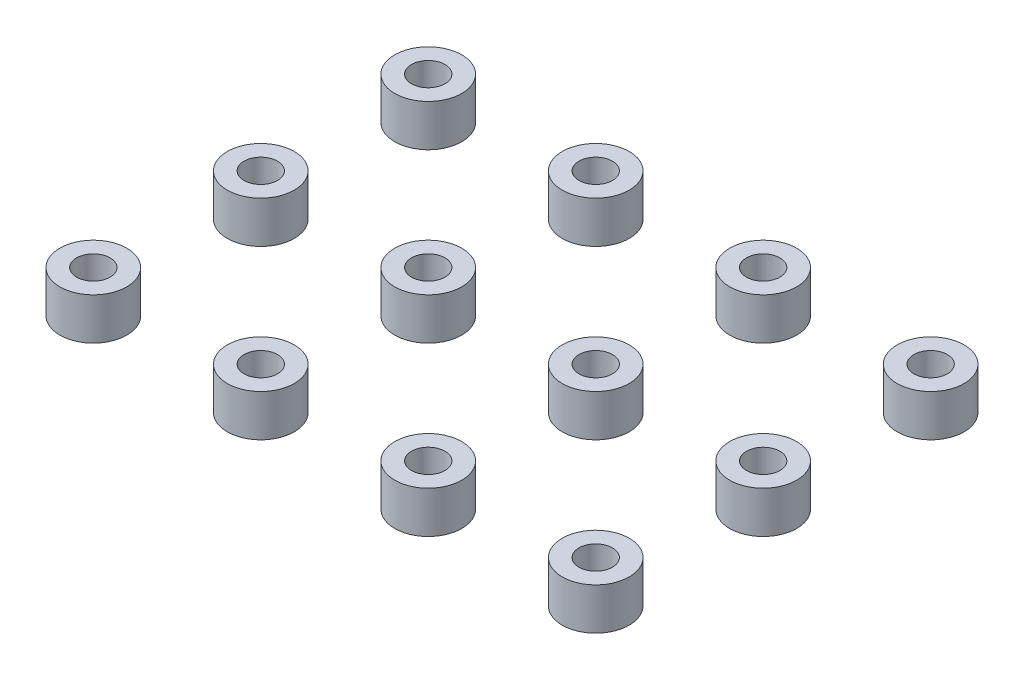
ISO-10303-21;
HEADER;
FILE_DESCRIPTION(('STEP AP214'),'2;1');
FILE_NAME('part.step','',(''),(''),'','','');
FILE_SCHEMA(('AUTOMOTIVE_DESIGN { 1 0 10303 214 1 1 1 1 }'));
ENDSEC;
DATA;
#1=APPLICATION_CONTEXT('core data for automotive mechanical design processes');
#2=APPLICATION_PROTOCOL_DEFINITION('international standard','automotive_design',2000,#1);
#3=PRODUCT_CONTEXT('',#1,'mechanical');
#4=PRODUCT('Part','Part','',(#3));
#5=PRODUCT_RELATED_PRODUCT_CATEGORY('part','',(#4));
#6=PRODUCT_DEFINITION_FORMATION('','',#4);
#7=PRODUCT_DEFINITION_CONTEXT('part definition',#1,'design');
#8=PRODUCT_DEFINITION('design','',#6,#7);
#9=PRODUCT_DEFINITION_SHAPE('','',#8);
#10=(LENGTH_UNIT() NAMED_UNIT(*) SI_UNIT(.MILLI.,.METRE.));
#11=(NAMED_UNIT(*) PLANE_ANGLE_UNIT() SI_UNIT($,.RADIAN.));
#12=(NAMED_UNIT(*) SI_UNIT($,.STERADIAN.) SOLID_ANGLE_UNIT());
#13=UNCERTAINTY_MEASURE_WITH_UNIT(LENGTH_MEASURE(1.E-05),#10,'distance_accuracy_value','');
#14=(GEOMETRIC_REPRESENTATION_CONTEXT(3) GLOBAL_UNCERTAINTY_ASSIGNED_CONTEXT((#13)) GLOBAL_UNIT_ASSIGNED_CONTEXT((#10,
#11,#12)) REPRESENTATION_CONTEXT('',''));
#15=CARTESIAN_POINT('',(0.,0.,0.));
#16=DIRECTION('',(0.,0.,1.));
#17=DIRECTION('',(1.,0.,0.));
#18=AXIS2_PLACEMENT_3D('',#15,#16,#17);
#19=CARTESIAN_POINT('',(-30.0000000000001,5.,-70.));
#20=DIRECTION('',(0.,1.,0.));
#21=DIRECTION('',(0.,0.,1.));
#22=AXIS2_PLACEMENT_3D('',#19,#20,#21);
#23=PLANE('',#22);
#24=CARTESIAN_POINT('',(-30.0000000000001,5.,-70.));
#25=DIRECTION('',(0.,1.,0.));
#26=DIRECTION('',(0.,0.,1.));
#27=AXIS2_PLACEMENT_3D('',#24,#25,#26);
#28=CIRCLE('',#27,4.);
#29=CARTESIAN_POINT('',(-30.0000000000001,5.,-66.));
#30=VERTEX_POINT('',#29);
#31=EDGE_CURVE('E11',#30,#30,#28,.T.);
#32=ORIENTED_EDGE('',*,*,#31,.T.);
#33=EDGE_LOOP('',(#32));
#34=FACE_BOUND('',#33,.T.);
#35=CARTESIAN_POINT('',(-30.0000000000001,5.,-70.));
#36=DIRECTION('',(0.,1.,0.));
#37=DIRECTION('',(0.,0.,1.));
#38=AXIS2_PLACEMENT_3D('',#35,#36,#37);
#39=CIRCLE('',#38,2.);
#40=CARTESIAN_POINT('',(-30.0000000000001,5.,-68.));
#41=VERTEX_POINT('',#40);
#42=EDGE_CURVE('E51',#41,#41,#39,.T.);
#43=ORIENTED_EDGE('',*,*,#42,.F.);
#44=EDGE_LOOP('',(#43));
#45=FACE_BOUND('',#44,.T.);
#46=ADVANCED_FACE('F40',(#34,#45),#23,.T.);
#47=CARTESIAN_POINT('',(-30.0000000000001,0.,-70.));
#48=DIRECTION('',(0.,1.,0.));
#49=DIRECTION('',(0.,0.,1.));
#50=AXIS2_PLACEMENT_3D('',#47,#48,#49);
#51=PLANE('',#50);
#52=CARTESIAN_POINT('',(-30.0000000000001,0.,-70.));
#53=DIRECTION('',(0.,1.,0.));
#54=DIRECTION('',(0.,0.,1.));
#55=AXIS2_PLACEMENT_3D('',#52,#53,#54);
#56=CIRCLE('',#55,4.);
#57=CARTESIAN_POINT('',(-30.0000000000001,0.,-66.));
#58=VERTEX_POINT('',#57);
#59=EDGE_CURVE('E44',#58,#58,#56,.T.);
#60=ORIENTED_EDGE('',*,*,#59,.F.);
#61=EDGE_LOOP('',(#60));
#62=FACE_BOUND('',#61,.T.);
#63=CARTESIAN_POINT('',(-30.0000000000001,0.,-70.));
#64=DIRECTION('',(0.,1.,0.));
#65=DIRECTION('',(0.,0.,1.));
#66=AXIS2_PLACEMENT_3D('',#63,#64,#65);
#67=CIRCLE('',#66,2.);
#68=CARTESIAN_POINT('',(-30.0000000000001,0.,-68.));
#69=VERTEX_POINT('',#68);
#70=EDGE_CURVE('E53',#69,#69,#67,.T.);
#71=ORIENTED_EDGE('',*,*,#70,.T.);
#72=EDGE_LOOP('',(#71));
#73=FACE_BOUND('',#72,.T.);
#74=ADVANCED_FACE('F63',(#62,#73),#51,.F.);
#75=CARTESIAN_POINT('',(-30.0000000000001,5.,-70.));
#76=DIRECTION('',(0.,-1.,0.));
#77=DIRECTION('',(0.,0.,-1.));
#78=AXIS2_PLACEMENT_3D('',#75,#76,#77);
#79=CYLINDRICAL_SURFACE('',#78,4.);
#80=ORIENTED_EDGE('',*,*,#31,.F.);
#81=EDGE_LOOP('',(#80));
#82=FACE_BOUND('',#81,.T.);
#83=ORIENTED_EDGE('',*,*,#59,.T.);
#84=EDGE_LOOP('',(#83));
#85=FACE_BOUND('',#84,.T.);
#86=ADVANCED_FACE('F42',(#82,#85),#79,.T.);
#87=CARTESIAN_POINT('',(-30.0000000000001,5.,-70.));
#88=DIRECTION('',(0.,-1.,0.));
#89=DIRECTION('',(0.,0.,-1.));
#90=AXIS2_PLACEMENT_3D('',#87,#88,#89);
#91=CYLINDRICAL_SURFACE('',#90,2.);
#92=ORIENTED_EDGE('',*,*,#42,.T.);
#93=EDGE_LOOP('',(#92));
#94=FACE_BOUND('',#93,.T.);
#95=ORIENTED_EDGE('',*,*,#70,.F.);
#96=EDGE_LOOP('',(#95));
#97=FACE_BOUND('',#96,.T.);
#98=ADVANCED_FACE('F59',(#94,#97),#91,.F.);
#99=CLOSED_SHELL('',(#46,#74,#86,#98));
#100=MANIFOLD_SOLID_BREP('B2',#99);
#101=CARTESIAN_POINT('',(-30.0000000000001,5.,-50.));
#102=DIRECTION('',(0.,1.,0.));
#103=DIRECTION('',(0.,0.,1.));
#104=AXIS2_PLACEMENT_3D('',#101,#102,#103);
#105=PLANE('',#104);
#106=CARTESIAN_POINT('',(-30.0000000000001,5.,-50.));
#107=DIRECTION('',(0.,1.,0.));
#108=DIRECTION('',(0.,0.,1.));
#109=AXIS2_PLACEMENT_3D('',#106,#107,#108);
#110=CIRCLE('',#109,4.);
#111=CARTESIAN_POINT('',(-30.0000000000001,5.,-46.));
#112=VERTEX_POINT('',#111);
#113=EDGE_CURVE('E39',#112,#112,#110,.T.);
#114=ORIENTED_EDGE('',*,*,#113,.T.);
#115=EDGE_LOOP('',(#114));
#116=FACE_BOUND('',#115,.T.);
#117=CARTESIAN_POINT('',(-30.0000000000001,5.,-50.));
#118=DIRECTION('',(0.,1.,0.));
#119=DIRECTION('',(0.,0.,1.));
#120=AXIS2_PLACEMENT_3D('',#117,#118,#119);
#121=CIRCLE('',#120,2.);
#122=CARTESIAN_POINT('',(-30.0000000000001,5.,-48.));
#123=VERTEX_POINT('',#122);
#124=EDGE_CURVE('E121',#123,#123,#121,.T.);
#125=ORIENTED_EDGE('',*,*,#124,.F.);
#126=EDGE_LOOP('',(#125));
#127=FACE_BOUND('',#126,.T.);
#128=ADVANCED_FACE('F110',(#116,#127),#105,.T.);
#129=CARTESIAN_POINT('',(-30.0000000000001,0.,-50.));
#130=DIRECTION('',(0.,1.,0.));
#131=DIRECTION('',(0.,0.,1.));
#132=AXIS2_PLACEMENT_3D('',#129,#130,#131);
#133=PLANE('',#132);
#134=CARTESIAN_POINT('',(-30.0000000000001,0.,-50.));
#135=DIRECTION('',(0.,1.,0.));
#136=DIRECTION('',(0.,0.,1.));
#137=AXIS2_PLACEMENT_3D('',#134,#135,#136);
#138=CIRCLE('',#137,4.);
#139=CARTESIAN_POINT('',(-30.0000000000001,0.,-46.));
#140=VERTEX_POINT('',#139);
#141=EDGE_CURVE('E114',#140,#140,#138,.T.);
#142=ORIENTED_EDGE('',*,*,#141,.F.);
#143=EDGE_LOOP('',(#142));
#144=FACE_BOUND('',#143,.T.);
#145=CARTESIAN_POINT('',(-30.0000000000001,0.,-50.));
#146=DIRECTION('',(0.,1.,0.));
#147=DIRECTION('',(0.,0.,1.));
#148=AXIS2_PLACEMENT_3D('',#145,#146,#147);
#149=CIRCLE('',#148,2.);
#150=CARTESIAN_POINT('',(-30.0000000000001,0.,-48.));
#151=VERTEX_POINT('',#150);
#152=EDGE_CURVE('E123',#151,#151,#149,.T.);
#153=ORIENTED_EDGE('',*,*,#152,.T.);
#154=EDGE_LOOP('',(#153));
#155=FACE_BOUND('',#154,.T.);
#156=ADVANCED_FACE('F133',(#144,#155),#133,.F.);
#157=CARTESIAN_POINT('',(-30.0000000000001,5.,-50.));
#158=DIRECTION('',(0.,-1.,0.));
#159=DIRECTION('',(0.,0.,-1.));
#160=AXIS2_PLACEMENT_3D('',#157,#158,#159);
#161=CYLINDRICAL_SURFACE('',#160,4.);
#162=ORIENTED_EDGE('',*,*,#113,.F.);
#163=EDGE_LOOP('',(#162));
#164=FACE_BOUND('',#163,.T.);
#165=ORIENTED_EDGE('',*,*,#141,.T.);
#166=EDGE_LOOP('',(#165));
#167=FACE_BOUND('',#166,.T.);
#168=ADVANCED_FACE('F112',(#164,#167),#161,.T.);
#169=CARTESIAN_POINT('',(-30.0000000000001,5.,-50.));
#170=DIRECTION('',(0.,-1.,0.));
#171=DIRECTION('',(0.,0.,-1.));
#172=AXIS2_PLACEMENT_3D('',#169,#170,#171);
#173=CYLINDRICAL_SURFACE('',#172,2.);
#174=ORIENTED_EDGE('',*,*,#124,.T.);
#175=EDGE_LOOP('',(#174));
#176=FACE_BOUND('',#175,.T.);
#177=ORIENTED_EDGE('',*,*,#152,.F.);
#178=EDGE_LOOP('',(#177));
#179=FACE_BOUND('',#178,.T.);
#180=ADVANCED_FACE('F129',(#176,#179),#173,.F.);
#181=CLOSED_SHELL('',(#128,#156,#168,#180));
#182=MANIFOLD_SOLID_BREP('B6',#181);
#183=CARTESIAN_POINT('',(29.9999999999999,5.,-70.));
#184=DIRECTION('',(0.,1.,0.));
#185=DIRECTION('',(0.,0.,1.));
#186=AXIS2_PLACEMENT_3D('',#183,#184,#185);
#187=PLANE('',#186);
#188=CARTESIAN_POINT('',(29.9999999999999,5.,-70.));
#189=DIRECTION('',(0.,1.,0.));
#190=DIRECTION('',(0.,0.,1.));
#191=AXIS2_PLACEMENT_3D('',#188,#189,#190);
#192=CIRCLE('',#191,4.);
#193=CARTESIAN_POINT('',(29.9999999999999,5.,-66.));
#194=VERTEX_POINT('',#193);
#195=EDGE_CURVE('E109',#194,#194,#192,.T.);
#196=ORIENTED_EDGE('',*,*,#195,.T.);
#197=EDGE_LOOP('',(#196));
#198=FACE_BOUND('',#197,.T.);
#199=CARTESIAN_POINT('',(29.9999999999999,5.,-70.));
#200=DIRECTION('',(0.,1.,0.));
#201=DIRECTION('',(0.,0.,1.));
#202=AXIS2_PLACEMENT_3D('',#199,#200,#201);
#203=CIRCLE('',#202,2.);
#204=CARTESIAN_POINT('',(29.9999999999999,5.,-68.));
#205=VERTEX_POINT('',#204);
#206=EDGE_CURVE('E191',#205,#205,#203,.T.);
#207=ORIENTED_EDGE('',*,*,#206,.F.);
#208=EDGE_LOOP('',(#207));
#209=FACE_BOUND('',#208,.T.);
#210=ADVANCED_FACE('F180',(#198,#209),#187,.T.);
#211=CARTESIAN_POINT('',(29.9999999999999,0.,-70.));
#212=DIRECTION('',(0.,1.,0.));
#213=DIRECTION('',(0.,0.,1.));
#214=AXIS2_PLACEMENT_3D('',#211,#212,#213);
#215=PLANE('',#214);
#216=CARTESIAN_POINT('',(29.9999999999999,0.,-70.));
#217=DIRECTION('',(0.,1.,0.));
#218=DIRECTION('',(0.,0.,1.));
#219=AXIS2_PLACEMENT_3D('',#216,#217,#218);
#220=CIRCLE('',#219,4.);
#221=CARTESIAN_POINT('',(29.9999999999999,0.,-66.));
#222=VERTEX_POINT('',#221);
#223=EDGE_CURVE('E184',#222,#222,#220,.T.);
#224=ORIENTED_EDGE('',*,*,#223,.F.);
#225=EDGE_LOOP('',(#224));
#226=FACE_BOUND('',#225,.T.);
#227=CARTESIAN_POINT('',(29.9999999999999,0.,-70.));
#228=DIRECTION('',(0.,1.,0.));
#229=DIRECTION('',(0.,0.,1.));
#230=AXIS2_PLACEMENT_3D('',#227,#228,#229);
#231=CIRCLE('',#230,2.);
#232=CARTESIAN_POINT('',(29.9999999999999,0.,-68.));
#233=VERTEX_POINT('',#232);
#234=EDGE_CURVE('E193',#233,#233,#231,.T.);
#235=ORIENTED_EDGE('',*,*,#234,.T.);
#236=EDGE_LOOP('',(#235));
#237=FACE_BOUND('',#236,.T.);
#238=ADVANCED_FACE('F203',(#226,#237),#215,.F.);
#239=CARTESIAN_POINT('',(29.9999999999999,5.,-70.));
#240=DIRECTION('',(0.,-1.,0.));
#241=DIRECTION('',(0.,0.,-1.));
#242=AXIS2_PLACEMENT_3D('',#239,#240,#241);
#243=CYLINDRICAL_SURFACE('',#242,4.);
#244=ORIENTED_EDGE('',*,*,#195,.F.);
#245=EDGE_LOOP('',(#244));
#246=FACE_BOUND('',#245,.T.);
#247=ORIENTED_EDGE('',*,*,#223,.T.);
#248=EDGE_LOOP('',(#247));
#249=FACE_BOUND('',#248,.T.);
#250=ADVANCED_FACE('F182',(#246,#249),#243,.T.);
#251=CARTESIAN_POINT('',(29.9999999999999,5.,-70.));
#252=DIRECTION('',(0.,-1.,0.));
#253=DIRECTION('',(0.,0.,-1.));
#254=AXIS2_PLACEMENT_3D('',#251,#252,#253);
#255=CYLINDRICAL_SURFACE('',#254,2.);
#256=ORIENTED_EDGE('',*,*,#206,.T.);
#257=EDGE_LOOP('',(#256));
#258=FACE_BOUND('',#257,.T.);
#259=ORIENTED_EDGE('',*,*,#234,.F.);
#260=EDGE_LOOP('',(#259));
#261=FACE_BOUND('',#260,.T.);
#262=ADVANCED_FACE('F199',(#258,#261),#255,.F.);
#263=CLOSED_SHELL('',(#210,#238,#250,#262));
#264=MANIFOLD_SOLID_BREP('B34',#263);
#265=CARTESIAN_POINT('',(9.99999999999986,5.,-70.));
#266=DIRECTION('',(0.,1.,0.));
#267=DIRECTION('',(0.,0.,1.));
#268=AXIS2_PLACEMENT_3D('',#265,#266,#267);
#269=PLANE('',#268);
#270=CARTESIAN_POINT('',(9.99999999999986,5.,-70.));
#271=DIRECTION('',(0.,1.,0.));
#272=DIRECTION('',(0.,0.,1.));
#273=AXIS2_PLACEMENT_3D('',#270,#271,#272);
#274=CIRCLE('',#273,4.);
#275=CARTESIAN_POINT('',(9.99999999999986,5.,-66.));
#276=VERTEX_POINT('',#275);
#277=EDGE_CURVE('E179',#276,#276,#274,.T.);
#278=ORIENTED_EDGE('',*,*,#277,.T.);
#279=EDGE_LOOP('',(#278));
#280=FACE_BOUND('',#279,.T.);
#281=CARTESIAN_POINT('',(9.99999999999986,5.,-70.));
#282=DIRECTION('',(0.,1.,0.));
#283=DIRECTION('',(0.,0.,1.));
#284=AXIS2_PLACEMENT_3D('',#281,#282,#283);
#285=CIRCLE('',#284,2.);
#286=CARTESIAN_POINT('',(9.99999999999986,5.,-68.));
#287=VERTEX_POINT('',#286);
#288=EDGE_CURVE('E261',#287,#287,#285,.T.);
#289=ORIENTED_EDGE('',*,*,#288,.F.);
#290=EDGE_LOOP('',(#289));
#291=FACE_BOUND('',#290,.T.);
#292=ADVANCED_FACE('F250',(#280,#291),#269,.T.);
#293=CARTESIAN_POINT('',(9.99999999999986,0.,-70.));
#294=DIRECTION('',(0.,1.,0.));
#295=DIRECTION('',(0.,0.,1.));
#296=AXIS2_PLACEMENT_3D('',#293,#294,#295);
#297=PLANE('',#296);
#298=CARTESIAN_POINT('',(9.99999999999986,0.,-70.));
#299=DIRECTION('',(0.,1.,0.));
#300=DIRECTION('',(0.,0.,1.));
#301=AXIS2_PLACEMENT_3D('',#298,#299,#300);
#302=CIRCLE('',#301,4.);
#303=CARTESIAN_POINT('',(9.99999999999986,0.,-66.));
#304=VERTEX_POINT('',#303);
#305=EDGE_CURVE('E254',#304,#304,#302,.T.);
#306=ORIENTED_EDGE('',*,*,#305,.F.);
#307=EDGE_LOOP('',(#306));
#308=FACE_BOUND('',#307,.T.);
#309=CARTESIAN_POINT('',(9.99999999999986,0.,-70.));
#310=DIRECTION('',(0.,1.,0.));
#311=DIRECTION('',(0.,0.,1.));
#312=AXIS2_PLACEMENT_3D('',#309,#310,#311);
#313=CIRCLE('',#312,2.);
#314=CARTESIAN_POINT('',(9.99999999999986,0.,-68.));
#315=VERTEX_POINT('',#314);
#316=EDGE_CURVE('E263',#315,#315,#313,.T.);
#317=ORIENTED_EDGE('',*,*,#316,.T.);
#318=EDGE_LOOP('',(#317));
#319=FACE_BOUND('',#318,.T.);
#320=ADVANCED_FACE('F273',(#308,#319),#297,.F.);
#321=CARTESIAN_POINT('',(9.99999999999986,5.,-70.));
#322=DIRECTION('',(0.,-1.,0.));
#323=DIRECTION('',(0.,0.,-1.));
#324=AXIS2_PLACEMENT_3D('',#321,#322,#323);
#325=CYLINDRICAL_SURFACE('',#324,4.);
#326=ORIENTED_EDGE('',*,*,#277,.F.);
#327=EDGE_LOOP('',(#326));
#328=FACE_BOUND('',#327,.T.);
#329=ORIENTED_EDGE('',*,*,#305,.T.);
#330=EDGE_LOOP('',(#329));
#331=FACE_BOUND('',#330,.T.);
#332=ADVANCED_FACE('F252',(#328,#331),#325,.T.);
#333=CARTESIAN_POINT('',(9.99999999999986,5.,-70.));
#334=DIRECTION('',(0.,-1.,0.));
#335=DIRECTION('',(0.,0.,-1.));
#336=AXIS2_PLACEMENT_3D('',#333,#334,#335);
#337=CYLINDRICAL_SURFACE('',#336,2.);
#338=ORIENTED_EDGE('',*,*,#288,.T.);
#339=EDGE_LOOP('',(#338));
#340=FACE_BOUND('',#339,.T.);
#341=ORIENTED_EDGE('',*,*,#316,.F.);
#342=EDGE_LOOP('',(#341));
#343=FACE_BOUND('',#342,.T.);
#344=ADVANCED_FACE('F269',(#340,#343),#337,.F.);
#345=CLOSED_SHELL('',(#292,#320,#332,#344));
#346=MANIFOLD_SOLID_BREP('B104',#345);
#347=CARTESIAN_POINT('',(-10.0000000000001,5.,-70.));
#348=DIRECTION('',(0.,1.,0.));
#349=DIRECTION('',(0.,0.,1.));
#350=AXIS2_PLACEMENT_3D('',#347,#348,#349);
#351=PLANE('',#350);
#352=CARTESIAN_POINT('',(-10.0000000000001,5.,-70.));
#353=DIRECTION('',(0.,1.,0.));
#354=DIRECTION('',(0.,0.,1.));
#355=AXIS2_PLACEMENT_3D('',#352,#353,#354);
#356=CIRCLE('',#355,4.);
#357=CARTESIAN_POINT('',(-10.0000000000001,5.,-66.));
#358=VERTEX_POINT('',#357);
#359=EDGE_CURVE('E249',#358,#358,#356,.T.);
#360=ORIENTED_EDGE('',*,*,#359,.T.);
#361=EDGE_LOOP('',(#360));
#362=FACE_BOUND('',#361,.T.);
#363=CARTESIAN_POINT('',(-10.0000000000001,5.,-70.));
#364=DIRECTION('',(0.,1.,0.));
#365=DIRECTION('',(0.,0.,1.));
#366=AXIS2_PLACEMENT_3D('',#363,#364,#365);
#367=CIRCLE('',#366,2.);
#368=CARTESIAN_POINT('',(-10.0000000000001,5.,-68.));
#369=VERTEX_POINT('',#368);
#370=EDGE_CURVE('E331',#369,#369,#367,.T.);
#371=ORIENTED_EDGE('',*,*,#370,.F.);
#372=EDGE_LOOP('',(#371));
#373=FACE_BOUND('',#372,.T.);
#374=ADVANCED_FACE('F320',(#362,#373),#351,.T.);
#375=CARTESIAN_POINT('',(-10.0000000000001,0.,-70.));
#376=DIRECTION('',(0.,1.,0.));
#377=DIRECTION('',(0.,0.,1.));
#378=AXIS2_PLACEMENT_3D('',#375,#376,#377);
#379=PLANE('',#378);
#380=CARTESIAN_POINT('',(-10.0000000000001,0.,-70.));
#381=DIRECTION('',(0.,1.,0.));
#382=DIRECTION('',(0.,0.,1.));
#383=AXIS2_PLACEMENT_3D('',#380,#381,#382);
#384=CIRCLE('',#383,4.);
#385=CARTESIAN_POINT('',(-10.0000000000001,0.,-66.));
#386=VERTEX_POINT('',#385);
#387=EDGE_CURVE('E324',#386,#386,#384,.T.);
#388=ORIENTED_EDGE('',*,*,#387,.F.);
#389=EDGE_LOOP('',(#388));
#390=FACE_BOUND('',#389,.T.);
#391=CARTESIAN_POINT('',(-10.0000000000001,0.,-70.));
#392=DIRECTION('',(0.,1.,0.));
#393=DIRECTION('',(0.,0.,1.));
#394=AXIS2_PLACEMENT_3D('',#391,#392,#393);
#395=CIRCLE('',#394,2.);
#396=CARTESIAN_POINT('',(-10.0000000000001,0.,-68.));
#397=VERTEX_POINT('',#396);
#398=EDGE_CURVE('E333',#397,#397,#395,.T.);
#399=ORIENTED_EDGE('',*,*,#398,.T.);
#400=EDGE_LOOP('',(#399));
#401=FACE_BOUND('',#400,.T.);
#402=ADVANCED_FACE('F343',(#390,#401),#379,.F.);
#403=CARTESIAN_POINT('',(-10.0000000000001,5.,-70.));
#404=DIRECTION('',(0.,-1.,0.));
#405=DIRECTION('',(0.,0.,-1.));
#406=AXIS2_PLACEMENT_3D('',#403,#404,#405);
#407=CYLINDRICAL_SURFACE('',#406,4.);
#408=ORIENTED_EDGE('',*,*,#359,.F.);
#409=EDGE_LOOP('',(#408));
#410=FACE_BOUND('',#409,.T.);
#411=ORIENTED_EDGE('',*,*,#387,.T.);
#412=EDGE_LOOP('',(#411));
#413=FACE_BOUND('',#412,.T.);
#414=ADVANCED_FACE('F322',(#410,#413),#407,.T.);
#415=CARTESIAN_POINT('',(-10.0000000000001,5.,-70.));
#416=DIRECTION('',(0.,-1.,0.));
#417=DIRECTION('',(0.,0.,-1.));
#418=AXIS2_PLACEMENT_3D('',#415,#416,#417);
#419=CYLINDRICAL_SURFACE('',#418,2.);
#420=ORIENTED_EDGE('',*,*,#370,.T.);
#421=EDGE_LOOP('',(#420));
#422=FACE_BOUND('',#421,.T.);
#423=ORIENTED_EDGE('',*,*,#398,.F.);
#424=EDGE_LOOP('',(#423));
#425=FACE_BOUND('',#424,.T.);
#426=ADVANCED_FACE('F339',(#422,#425),#419,.F.);
#427=CLOSED_SHELL('',(#374,#402,#414,#426));
#428=MANIFOLD_SOLID_BREP('B174',#427);
#429=CARTESIAN_POINT('',(29.9999999999999,5.,-50.));
#430=DIRECTION('',(0.,1.,0.));
#431=DIRECTION('',(0.,0.,1.));
#432=AXIS2_PLACEMENT_3D('',#429,#430,#431);
#433=PLANE('',#432);
#434=CARTESIAN_POINT('',(29.9999999999999,5.,-50.));
#435=DIRECTION('',(0.,1.,0.));
#436=DIRECTION('',(0.,0.,1.));
#437=AXIS2_PLACEMENT_3D('',#434,#435,#436);
#438=CIRCLE('',#437,4.);
#439=CARTESIAN_POINT('',(29.9999999999999,5.,-46.));
#440=VERTEX_POINT('',#439);
#441=EDGE_CURVE('E319',#440,#440,#438,.T.);
#442=ORIENTED_EDGE('',*,*,#441,.T.);
#443=EDGE_LOOP('',(#442));
#444=FACE_BOUND('',#443,.T.);
#445=CARTESIAN_POINT('',(29.9999999999999,5.,-50.));
#446=DIRECTION('',(0.,1.,0.));
#447=DIRECTION('',(0.,0.,1.));
#448=AXIS2_PLACEMENT_3D('',#445,#446,#447);
#449=CIRCLE('',#448,2.);
#450=CARTESIAN_POINT('',(29.9999999999999,5.,-48.));
#451=VERTEX_POINT('',#450);
#452=EDGE_CURVE('E401',#451,#451,#449,.T.);
#453=ORIENTED_EDGE('',*,*,#452,.F.);
#454=EDGE_LOOP('',(#453));
#455=FACE_BOUND('',#454,.T.);
#456=ADVANCED_FACE('F390',(#444,#455),#433,.T.);
#457=CARTESIAN_POINT('',(29.9999999999999,0.,-50.));
#458=DIRECTION('',(0.,1.,0.));
#459=DIRECTION('',(0.,0.,1.));
#460=AXIS2_PLACEMENT_3D('',#457,#458,#459);
#461=PLANE('',#460);
#462=CARTESIAN_POINT('',(29.9999999999999,0.,-50.));
#463=DIRECTION('',(0.,1.,0.));
#464=DIRECTION('',(0.,0.,1.));
#465=AXIS2_PLACEMENT_3D('',#462,#463,#464);
#466=CIRCLE('',#465,4.);
#467=CARTESIAN_POINT('',(29.9999999999999,0.,-46.));
#468=VERTEX_POINT('',#467);
#469=EDGE_CURVE('E394',#468,#468,#466,.T.);
#470=ORIENTED_EDGE('',*,*,#469,.F.);
#471=EDGE_LOOP('',(#470));
#472=FACE_BOUND('',#471,.T.);
#473=CARTESIAN_POINT('',(29.9999999999999,0.,-50.));
#474=DIRECTION('',(0.,1.,0.));
#475=DIRECTION('',(0.,0.,1.));
#476=AXIS2_PLACEMENT_3D('',#473,#474,#475);
#477=CIRCLE('',#476,2.);
#478=CARTESIAN_POINT('',(29.9999999999999,0.,-48.));
#479=VERTEX_POINT('',#478);
#480=EDGE_CURVE('E403',#479,#479,#477,.T.);
#481=ORIENTED_EDGE('',*,*,#480,.T.);
#482=EDGE_LOOP('',(#481));
#483=FACE_BOUND('',#482,.T.);
#484=ADVANCED_FACE('F413',(#472,#483),#461,.F.);
#485=CARTESIAN_POINT('',(29.9999999999999,5.,-50.));
#486=DIRECTION('',(0.,-1.,0.));
#487=DIRECTION('',(0.,0.,-1.));
#488=AXIS2_PLACEMENT_3D('',#485,#486,#487);
#489=CYLINDRICAL_SURFACE('',#488,4.);
#490=ORIENTED_EDGE('',*,*,#441,.F.);
#491=EDGE_LOOP('',(#490));
#492=FACE_BOUND('',#491,.T.);
#493=ORIENTED_EDGE('',*,*,#469,.T.);
#494=EDGE_LOOP('',(#493));
#495=FACE_BOUND('',#494,.T.);
#496=ADVANCED_FACE('F392',(#492,#495),#489,.T.);
#497=CARTESIAN_POINT('',(29.9999999999999,5.,-50.));
#498=DIRECTION('',(0.,-1.,0.));
#499=DIRECTION('',(0.,0.,-1.));
#500=AXIS2_PLACEMENT_3D('',#497,#498,#499);
#501=CYLINDRICAL_SURFACE('',#500,2.);
#502=ORIENTED_EDGE('',*,*,#452,.T.);
#503=EDGE_LOOP('',(#502));
#504=FACE_BOUND('',#503,.T.);
#505=ORIENTED_EDGE('',*,*,#480,.F.);
#506=EDGE_LOOP('',(#505));
#507=FACE_BOUND('',#506,.T.);
#508=ADVANCED_FACE('F409',(#504,#507),#501,.F.);
#509=CLOSED_SHELL('',(#456,#484,#496,#508));
#510=MANIFOLD_SOLID_BREP('B244',#509);
#511=CARTESIAN_POINT('',(9.99999999999993,5.,-50.));
#512=DIRECTION('',(0.,1.,0.));
#513=DIRECTION('',(0.,0.,1.));
#514=AXIS2_PLACEMENT_3D('',#511,#512,#513);
#515=PLANE('',#514);
#516=CARTESIAN_POINT('',(9.99999999999993,5.,-50.));
#517=DIRECTION('',(0.,1.,0.));
#518=DIRECTION('',(0.,0.,1.));
#519=AXIS2_PLACEMENT_3D('',#516,#517,#518);
#520=CIRCLE('',#519,4.);
#521=CARTESIAN_POINT('',(9.99999999999993,5.,-46.));
#522=VERTEX_POINT('',#521);
#523=EDGE_CURVE('E389',#522,#522,#520,.T.);
#524=ORIENTED_EDGE('',*,*,#523,.T.);
#525=EDGE_LOOP('',(#524));
#526=FACE_BOUND('',#525,.T.);
#527=CARTESIAN_POINT('',(9.99999999999993,5.,-50.));
#528=DIRECTION('',(0.,1.,0.));
#529=DIRECTION('',(0.,0.,1.));
#530=AXIS2_PLACEMENT_3D('',#527,#528,#529);
#531=CIRCLE('',#530,2.);
#532=CARTESIAN_POINT('',(9.99999999999993,5.,-48.));
#533=VERTEX_POINT('',#532);
#534=EDGE_CURVE('E471',#533,#533,#531,.T.);
#535=ORIENTED_EDGE('',*,*,#534,.F.);
#536=EDGE_LOOP('',(#535));
#537=FACE_BOUND('',#536,.T.);
#538=ADVANCED_FACE('F460',(#526,#537),#515,.T.);
#539=CARTESIAN_POINT('',(9.99999999999993,0.,-50.));
#540=DIRECTION('',(0.,1.,0.));
#541=DIRECTION('',(0.,0.,1.));
#542=AXIS2_PLACEMENT_3D('',#539,#540,#541);
#543=PLANE('',#542);
#544=CARTESIAN_POINT('',(9.99999999999993,0.,-50.));
#545=DIRECTION('',(0.,1.,0.));
#546=DIRECTION('',(0.,0.,1.));
#547=AXIS2_PLACEMENT_3D('',#544,#545,#546);
#548=CIRCLE('',#547,4.);
#549=CARTESIAN_POINT('',(9.99999999999993,0.,-46.));
#550=VERTEX_POINT('',#549);
#551=EDGE_CURVE('E464',#550,#550,#548,.T.);
#552=ORIENTED_EDGE('',*,*,#551,.F.);
#553=EDGE_LOOP('',(#552));
#554=FACE_BOUND('',#553,.T.);
#555=CARTESIAN_POINT('',(9.99999999999993,0.,-50.));
#556=DIRECTION('',(0.,1.,0.));
#557=DIRECTION('',(0.,0.,1.));
#558=AXIS2_PLACEMENT_3D('',#555,#556,#557);
#559=CIRCLE('',#558,2.);
#560=CARTESIAN_POINT('',(9.99999999999993,0.,-48.));
#561=VERTEX_POINT('',#560);
#562=EDGE_CURVE('E473',#561,#561,#559,.T.);
#563=ORIENTED_EDGE('',*,*,#562,.T.);
#564=EDGE_LOOP('',(#563));
#565=FACE_BOUND('',#564,.T.);
#566=ADVANCED_FACE('F483',(#554,#565),#543,.F.);
#567=CARTESIAN_POINT('',(9.99999999999993,5.,-50.));
#568=DIRECTION('',(0.,-1.,0.));
#569=DIRECTION('',(0.,0.,-1.));
#570=AXIS2_PLACEMENT_3D('',#567,#568,#569);
#571=CYLINDRICAL_SURFACE('',#570,4.);
#572=ORIENTED_EDGE('',*,*,#523,.F.);
#573=EDGE_LOOP('',(#572));
#574=FACE_BOUND('',#573,.T.);
#575=ORIENTED_EDGE('',*,*,#551,.T.);
#576=EDGE_LOOP('',(#575));
#577=FACE_BOUND('',#576,.T.);
#578=ADVANCED_FACE('F462',(#574,#577),#571,.T.);
#579=CARTESIAN_POINT('',(9.99999999999993,5.,-50.));
#580=DIRECTION('',(0.,-1.,0.));
#581=DIRECTION('',(0.,0.,-1.));
#582=AXIS2_PLACEMENT_3D('',#579,#580,#581);
#583=CYLINDRICAL_SURFACE('',#582,2.);
#584=ORIENTED_EDGE('',*,*,#534,.T.);
#585=EDGE_LOOP('',(#584));
#586=FACE_BOUND('',#585,.T.);
#587=ORIENTED_EDGE('',*,*,#562,.F.);
#588=EDGE_LOOP('',(#587));
#589=FACE_BOUND('',#588,.T.);
#590=ADVANCED_FACE('F479',(#586,#589),#583,.F.);
#591=CLOSED_SHELL('',(#538,#566,#578,#590));
#592=MANIFOLD_SOLID_BREP('B314',#591);
#593=CARTESIAN_POINT('',(-10.0000000000001,5.,-50.));
#594=DIRECTION('',(0.,1.,0.));
#595=DIRECTION('',(0.,0.,1.));
#596=AXIS2_PLACEMENT_3D('',#593,#594,#595);
#597=PLANE('',#596);
#598=CARTESIAN_POINT('',(-10.0000000000001,5.,-50.));
#599=DIRECTION('',(0.,1.,0.));
#600=DIRECTION('',(0.,0.,1.));
#601=AXIS2_PLACEMENT_3D('',#598,#599,#600);
#602=CIRCLE('',#601,4.);
#603=CARTESIAN_POINT('',(-10.0000000000001,5.,-46.));
#604=VERTEX_POINT('',#603);
#605=EDGE_CURVE('E459',#604,#604,#602,.T.);
#606=ORIENTED_EDGE('',*,*,#605,.T.);
#607=EDGE_LOOP('',(#606));
#608=FACE_BOUND('',#607,.T.);
#609=CARTESIAN_POINT('',(-10.0000000000001,5.,-50.));
#610=DIRECTION('',(0.,1.,0.));
#611=DIRECTION('',(0.,0.,1.));
#612=AXIS2_PLACEMENT_3D('',#609,#610,#611);
#613=CIRCLE('',#612,2.);
#614=CARTESIAN_POINT('',(-10.0000000000001,5.,-48.));
#615=VERTEX_POINT('',#614);
#616=EDGE_CURVE('E541',#615,#615,#613,.T.);
#617=ORIENTED_EDGE('',*,*,#616,.F.);
#618=EDGE_LOOP('',(#617));
#619=FACE_BOUND('',#618,.T.);
#620=ADVANCED_FACE('F530',(#608,#619),#597,.T.);
#621=CARTESIAN_POINT('',(-10.0000000000001,0.,-50.));
#622=DIRECTION('',(0.,1.,0.));
#623=DIRECTION('',(0.,0.,1.));
#624=AXIS2_PLACEMENT_3D('',#621,#622,#623);
#625=PLANE('',#624);
#626=CARTESIAN_POINT('',(-10.0000000000001,0.,-50.));
#627=DIRECTION('',(0.,1.,0.));
#628=DIRECTION('',(0.,0.,1.));
#629=AXIS2_PLACEMENT_3D('',#626,#627,#628);
#630=CIRCLE('',#629,4.);
#631=CARTESIAN_POINT('',(-10.0000000000001,0.,-46.));
#632=VERTEX_POINT('',#631);
#633=EDGE_CURVE('E534',#632,#632,#630,.T.);
#634=ORIENTED_EDGE('',*,*,#633,.F.);
#635=EDGE_LOOP('',(#634));
#636=FACE_BOUND('',#635,.T.);
#637=CARTESIAN_POINT('',(-10.0000000000001,0.,-50.));
#638=DIRECTION('',(0.,1.,0.));
#639=DIRECTION('',(0.,0.,1.));
#640=AXIS2_PLACEMENT_3D('',#637,#638,#639);
#641=CIRCLE('',#640,2.);
#642=CARTESIAN_POINT('',(-10.0000000000001,0.,-48.));
#643=VERTEX_POINT('',#642);
#644=EDGE_CURVE('E543',#643,#643,#641,.T.);
#645=ORIENTED_EDGE('',*,*,#644,.T.);
#646=EDGE_LOOP('',(#645));
#647=FACE_BOUND('',#646,.T.);
#648=ADVANCED_FACE('F553',(#636,#647),#625,.F.);
#649=CARTESIAN_POINT('',(-10.0000000000001,5.,-50.));
#650=DIRECTION('',(0.,-1.,0.));
#651=DIRECTION('',(0.,0.,-1.));
#652=AXIS2_PLACEMENT_3D('',#649,#650,#651);
#653=CYLINDRICAL_SURFACE('',#652,4.);
#654=ORIENTED_EDGE('',*,*,#605,.F.);
#655=EDGE_LOOP('',(#654));
#656=FACE_BOUND('',#655,.T.);
#657=ORIENTED_EDGE('',*,*,#633,.T.);
#658=EDGE_LOOP('',(#657));
#659=FACE_BOUND('',#658,.T.);
#660=ADVANCED_FACE('F532',(#656,#659),#653,.T.);
#661=CARTESIAN_POINT('',(-10.0000000000001,5.,-50.));
#662=DIRECTION('',(0.,-1.,0.));
#663=DIRECTION('',(0.,0.,-1.));
#664=AXIS2_PLACEMENT_3D('',#661,#662,#663);
#665=CYLINDRICAL_SURFACE('',#664,2.);
#666=ORIENTED_EDGE('',*,*,#616,.T.);
#667=EDGE_LOOP('',(#666));
#668=FACE_BOUND('',#667,.T.);
#669=ORIENTED_EDGE('',*,*,#644,.F.);
#670=EDGE_LOOP('',(#669));
#671=FACE_BOUND('',#670,.T.);
#672=ADVANCED_FACE('F549',(#668,#671),#665,.F.);
#673=CLOSED_SHELL('',(#620,#648,#660,#672));
#674=MANIFOLD_SOLID_BREP('B384',#673);
#675=CARTESIAN_POINT('',(30.,5.,-30.));
#676=DIRECTION('',(0.,1.,0.));
#677=DIRECTION('',(0.,0.,1.));
#678=AXIS2_PLACEMENT_3D('',#675,#676,#677);
#679=PLANE('',#678);
#680=CARTESIAN_POINT('',(30.,5.,-30.));
#681=DIRECTION('',(0.,1.,0.));
#682=DIRECTION('',(0.,0.,1.));
#683=AXIS2_PLACEMENT_3D('',#680,#681,#682);
#684=CIRCLE('',#683,4.);
#685=CARTESIAN_POINT('',(30.,5.,-26.));
#686=VERTEX_POINT('',#685);
#687=EDGE_CURVE('E529',#686,#686,#684,.T.);
#688=ORIENTED_EDGE('',*,*,#687,.T.);
#689=EDGE_LOOP('',(#688));
#690=FACE_BOUND('',#689,.T.);
#691=CARTESIAN_POINT('',(30.,5.,-30.));
#692=DIRECTION('',(0.,1.,0.));
#693=DIRECTION('',(0.,0.,1.));
#694=AXIS2_PLACEMENT_3D('',#691,#692,#693);
#695=CIRCLE('',#694,2.);
#696=CARTESIAN_POINT('',(30.,5.,-28.));
#697=VERTEX_POINT('',#696);
#698=EDGE_CURVE('E611',#697,#697,#695,.T.);
#699=ORIENTED_EDGE('',*,*,#698,.F.);
#700=EDGE_LOOP('',(#699));
#701=FACE_BOUND('',#700,.T.);
#702=ADVANCED_FACE('F600',(#690,#701),#679,.T.);
#703=CARTESIAN_POINT('',(30.,0.,-30.));
#704=DIRECTION('',(0.,1.,0.));
#705=DIRECTION('',(0.,0.,1.));
#706=AXIS2_PLACEMENT_3D('',#703,#704,#705);
#707=PLANE('',#706);
#708=CARTESIAN_POINT('',(30.,0.,-30.));
#709=DIRECTION('',(0.,1.,0.));
#710=DIRECTION('',(0.,0.,1.));
#711=AXIS2_PLACEMENT_3D('',#708,#709,#710);
#712=CIRCLE('',#711,4.);
#713=CARTESIAN_POINT('',(30.,0.,-26.));
#714=VERTEX_POINT('',#713);
#715=EDGE_CURVE('E604',#714,#714,#712,.T.);
#716=ORIENTED_EDGE('',*,*,#715,.F.);
#717=EDGE_LOOP('',(#716));
#718=FACE_BOUND('',#717,.T.);
#719=CARTESIAN_POINT('',(30.,0.,-30.));
#720=DIRECTION('',(0.,1.,0.));
#721=DIRECTION('',(0.,0.,1.));
#722=AXIS2_PLACEMENT_3D('',#719,#720,#721);
#723=CIRCLE('',#722,2.);
#724=CARTESIAN_POINT('',(30.,0.,-28.));
#725=VERTEX_POINT('',#724);
#726=EDGE_CURVE('E613',#725,#725,#723,.T.);
#727=ORIENTED_EDGE('',*,*,#726,.T.);
#728=EDGE_LOOP('',(#727));
#729=FACE_BOUND('',#728,.T.);
#730=ADVANCED_FACE('F623',(#718,#729),#707,.F.);
#731=CARTESIAN_POINT('',(30.,5.,-30.));
#732=DIRECTION('',(0.,-1.,0.));
#733=DIRECTION('',(0.,0.,-1.));
#734=AXIS2_PLACEMENT_3D('',#731,#732,#733);
#735=CYLINDRICAL_SURFACE('',#734,4.);
#736=ORIENTED_EDGE('',*,*,#687,.F.);
#737=EDGE_LOOP('',(#736));
#738=FACE_BOUND('',#737,.T.);
#739=ORIENTED_EDGE('',*,*,#715,.T.);
#740=EDGE_LOOP('',(#739));
#741=FACE_BOUND('',#740,.T.);
#742=ADVANCED_FACE('F602',(#738,#741),#735,.T.);
#743=CARTESIAN_POINT('',(30.,5.,-30.));
#744=DIRECTION('',(0.,-1.,0.));
#745=DIRECTION('',(0.,0.,-1.));
#746=AXIS2_PLACEMENT_3D('',#743,#744,#745);
#747=CYLINDRICAL_SURFACE('',#746,2.);
#748=ORIENTED_EDGE('',*,*,#698,.T.);
#749=EDGE_LOOP('',(#748));
#750=FACE_BOUND('',#749,.T.);
#751=ORIENTED_EDGE('',*,*,#726,.F.);
#752=EDGE_LOOP('',(#751));
#753=FACE_BOUND('',#752,.T.);
#754=ADVANCED_FACE('F619',(#750,#753),#747,.F.);
#755=CLOSED_SHELL('',(#702,#730,#742,#754));
#756=MANIFOLD_SOLID_BREP('B454',#755);
#757=CARTESIAN_POINT('',(10.,5.,-30.));
#758=DIRECTION('',(0.,1.,0.));
#759=DIRECTION('',(0.,0.,1.));
#760=AXIS2_PLACEMENT_3D('',#757,#758,#759);
#761=PLANE('',#760);
#762=CARTESIAN_POINT('',(10.,5.,-30.));
#763=DIRECTION('',(0.,1.,0.));
#764=DIRECTION('',(0.,0.,1.));
#765=AXIS2_PLACEMENT_3D('',#762,#763,#764);
#766=CIRCLE('',#765,4.);
#767=CARTESIAN_POINT('',(10.,5.,-26.));
#768=VERTEX_POINT('',#767);
#769=EDGE_CURVE('E599',#768,#768,#766,.T.);
#770=ORIENTED_EDGE('',*,*,#769,.T.);
#771=EDGE_LOOP('',(#770));
#772=FACE_BOUND('',#771,.T.);
#773=CARTESIAN_POINT('',(10.,5.,-30.));
#774=DIRECTION('',(0.,1.,0.));
#775=DIRECTION('',(0.,0.,1.));
#776=AXIS2_PLACEMENT_3D('',#773,#774,#775);
#777=CIRCLE('',#776,2.);
#778=CARTESIAN_POINT('',(10.,5.,-28.));
#779=VERTEX_POINT('',#778);
#780=EDGE_CURVE('E681',#779,#779,#777,.T.);
#781=ORIENTED_EDGE('',*,*,#780,.F.);
#782=EDGE_LOOP('',(#781));
#783=FACE_BOUND('',#782,.T.);
#784=ADVANCED_FACE('F670',(#772,#783),#761,.T.);
#785=CARTESIAN_POINT('',(10.,0.,-30.));
#786=DIRECTION('',(0.,1.,0.));
#787=DIRECTION('',(0.,0.,1.));
#788=AXIS2_PLACEMENT_3D('',#785,#786,#787);
#789=PLANE('',#788);
#790=CARTESIAN_POINT('',(10.,0.,-30.));
#791=DIRECTION('',(0.,1.,0.));
#792=DIRECTION('',(0.,0.,1.));
#793=AXIS2_PLACEMENT_3D('',#790,#791,#792);
#794=CIRCLE('',#793,4.);
#795=CARTESIAN_POINT('',(10.,0.,-26.));
#796=VERTEX_POINT('',#795);
#797=EDGE_CURVE('E674',#796,#796,#794,.T.);
#798=ORIENTED_EDGE('',*,*,#797,.F.);
#799=EDGE_LOOP('',(#798));
#800=FACE_BOUND('',#799,.T.);
#801=CARTESIAN_POINT('',(10.,0.,-30.));
#802=DIRECTION('',(0.,1.,0.));
#803=DIRECTION('',(0.,0.,1.));
#804=AXIS2_PLACEMENT_3D('',#801,#802,#803);
#805=CIRCLE('',#804,2.);
#806=CARTESIAN_POINT('',(10.,0.,-28.));
#807=VERTEX_POINT('',#806);
#808=EDGE_CURVE('E683',#807,#807,#805,.T.);
#809=ORIENTED_EDGE('',*,*,#808,.T.);
#810=EDGE_LOOP('',(#809));
#811=FACE_BOUND('',#810,.T.);
#812=ADVANCED_FACE('F693',(#800,#811),#789,.F.);
#813=CARTESIAN_POINT('',(10.,5.,-30.));
#814=DIRECTION('',(0.,-1.,0.));
#815=DIRECTION('',(0.,0.,-1.));
#816=AXIS2_PLACEMENT_3D('',#813,#814,#815);
#817=CYLINDRICAL_SURFACE('',#816,4.);
#818=ORIENTED_EDGE('',*,*,#769,.F.);
#819=EDGE_LOOP('',(#818));
#820=FACE_BOUND('',#819,.T.);
#821=ORIENTED_EDGE('',*,*,#797,.T.);
#822=EDGE_LOOP('',(#821));
#823=FACE_BOUND('',#822,.T.);
#824=ADVANCED_FACE('F672',(#820,#823),#817,.T.);
#825=CARTESIAN_POINT('',(10.,5.,-30.));
#826=DIRECTION('',(0.,-1.,0.));
#827=DIRECTION('',(0.,0.,-1.));
#828=AXIS2_PLACEMENT_3D('',#825,#826,#827);
#829=CYLINDRICAL_SURFACE('',#828,2.);
#830=ORIENTED_EDGE('',*,*,#780,.T.);
#831=EDGE_LOOP('',(#830));
#832=FACE_BOUND('',#831,.T.);
#833=ORIENTED_EDGE('',*,*,#808,.F.);
#834=EDGE_LOOP('',(#833));
#835=FACE_BOUND('',#834,.T.);
#836=ADVANCED_FACE('F689',(#832,#835),#829,.F.);
#837=CLOSED_SHELL('',(#784,#812,#824,#836));
#838=MANIFOLD_SOLID_BREP('B524',#837);
#839=CARTESIAN_POINT('',(-10.,5.,-30.));
#840=DIRECTION('',(0.,1.,0.));
#841=DIRECTION('',(0.,0.,1.));
#842=AXIS2_PLACEMENT_3D('',#839,#840,#841);
#843=PLANE('',#842);
#844=CARTESIAN_POINT('',(-10.,5.,-30.));
#845=DIRECTION('',(0.,1.,0.));
#846=DIRECTION('',(0.,0.,1.));
#847=AXIS2_PLACEMENT_3D('',#844,#845,#846);
#848=CIRCLE('',#847,4.);
#849=CARTESIAN_POINT('',(-10.,5.,-26.));
#850=VERTEX_POINT('',#849);
#851=EDGE_CURVE('E669',#850,#850,#848,.T.);
#852=ORIENTED_EDGE('',*,*,#851,.T.);
#853=EDGE_LOOP('',(#852));
#854=FACE_BOUND('',#853,.T.);
#855=CARTESIAN_POINT('',(-10.,5.,-30.));
#856=DIRECTION('',(0.,1.,0.));
#857=DIRECTION('',(0.,0.,1.));
#858=AXIS2_PLACEMENT_3D('',#855,#856,#857);
#859=CIRCLE('',#858,2.);
#860=CARTESIAN_POINT('',(-10.,5.,-28.));
#861=VERTEX_POINT('',#860);
#862=EDGE_CURVE('E750',#861,#861,#859,.T.);
#863=ORIENTED_EDGE('',*,*,#862,.F.);
#864=EDGE_LOOP('',(#863));
#865=FACE_BOUND('',#864,.T.);
#866=ADVANCED_FACE('F739',(#854,#865),#843,.T.);
#867=CARTESIAN_POINT('',(-10.,0.,-30.));
#868=DIRECTION('',(0.,1.,0.));
#869=DIRECTION('',(0.,0.,1.));
#870=AXIS2_PLACEMENT_3D('',#867,#868,#869);
#871=PLANE('',#870);
#872=CARTESIAN_POINT('',(-10.,0.,-30.));
#873=DIRECTION('',(0.,1.,0.));
#874=DIRECTION('',(0.,0.,1.));
#875=AXIS2_PLACEMENT_3D('',#872,#873,#874);
#876=CIRCLE('',#875,4.);
#877=CARTESIAN_POINT('',(-10.,0.,-26.));
#878=VERTEX_POINT('',#877);
#879=EDGE_CURVE('E743',#878,#878,#876,.T.);
#880=ORIENTED_EDGE('',*,*,#879,.F.);
#881=EDGE_LOOP('',(#880));
#882=FACE_BOUND('',#881,.T.);
#883=CARTESIAN_POINT('',(-10.,0.,-30.));
#884=DIRECTION('',(0.,1.,0.));
#885=DIRECTION('',(0.,0.,1.));
#886=AXIS2_PLACEMENT_3D('',#883,#884,#885);
#887=CIRCLE('',#886,2.);
#888=CARTESIAN_POINT('',(-10.,0.,-28.));
#889=VERTEX_POINT('',#888);
#890=EDGE_CURVE('E752',#889,#889,#887,.T.);
#891=ORIENTED_EDGE('',*,*,#890,.T.);
#892=EDGE_LOOP('',(#891));
#893=FACE_BOUND('',#892,.T.);
#894=ADVANCED_FACE('F762',(#882,#893),#871,.F.);
#895=CARTESIAN_POINT('',(-10.,5.,-30.));
#896=DIRECTION('',(0.,-1.,0.));
#897=DIRECTION('',(0.,0.,-1.));
#898=AXIS2_PLACEMENT_3D('',#895,#896,#897);
#899=CYLINDRICAL_SURFACE('',#898,4.);
#900=ORIENTED_EDGE('',*,*,#851,.F.);
#901=EDGE_LOOP('',(#900));
#902=FACE_BOUND('',#901,.T.);
#903=ORIENTED_EDGE('',*,*,#879,.T.);
#904=EDGE_LOOP('',(#903));
#905=FACE_BOUND('',#904,.T.);
#906=ADVANCED_FACE('F741',(#902,#905),#899,.T.);
#907=CARTESIAN_POINT('',(-10.,5.,-30.));
#908=DIRECTION('',(0.,-1.,0.));
#909=DIRECTION('',(0.,0.,-1.));
#910=AXIS2_PLACEMENT_3D('',#907,#908,#909);
#911=CYLINDRICAL_SURFACE('',#910,2.);
#912=ORIENTED_EDGE('',*,*,#862,.T.);
#913=EDGE_LOOP('',(#912));
#914=FACE_BOUND('',#913,.T.);
#915=ORIENTED_EDGE('',*,*,#890,.F.);
#916=EDGE_LOOP('',(#915));
#917=FACE_BOUND('',#916,.T.);
#918=ADVANCED_FACE('F758',(#914,#917),#911,.F.);
#919=CLOSED_SHELL('',(#866,#894,#906,#918));
#920=MANIFOLD_SOLID_BREP('B594',#919);
#921=CARTESIAN_POINT('',(-30.,5.,-30.));
#922=DIRECTION('',(0.,1.,0.));
#923=DIRECTION('',(0.,0.,1.));
#924=AXIS2_PLACEMENT_3D('',#921,#922,#923);
#925=PLANE('',#924);
#926=CARTESIAN_POINT('',(-30.,5.,-30.));
#927=DIRECTION('',(0.,1.,0.));
#928=DIRECTION('',(0.,0.,1.));
#929=AXIS2_PLACEMENT_3D('',#926,#927,#928);
#930=CIRCLE('',#929,4.);
#931=CARTESIAN_POINT('',(-30.,5.,-26.));
#932=VERTEX_POINT('',#931);
#933=EDGE_CURVE('E738',#932,#932,#930,.T.);
#934=ORIENTED_EDGE('',*,*,#933,.T.);
#935=EDGE_LOOP('',(#934));
#936=FACE_BOUND('',#935,.T.);
#937=CARTESIAN_POINT('',(-30.,5.,-30.));
#938=DIRECTION('',(0.,1.,0.));
#939=DIRECTION('',(0.,0.,1.));
#940=AXIS2_PLACEMENT_3D('',#937,#938,#939);
#941=CIRCLE('',#940,2.);
#942=CARTESIAN_POINT('',(-30.,5.,-28.));
#943=VERTEX_POINT('',#942);
#944=EDGE_CURVE('E812',#943,#943,#941,.T.);
#945=ORIENTED_EDGE('',*,*,#944,.F.);
#946=EDGE_LOOP('',(#945));
#947=FACE_BOUND('',#946,.T.);
#948=ADVANCED_FACE('F801',(#936,#947),#925,.T.);
#949=CARTESIAN_POINT('',(-30.,0.,-30.));
#950=DIRECTION('',(0.,1.,0.));
#951=DIRECTION('',(0.,0.,1.));
#952=AXIS2_PLACEMENT_3D('',#949,#950,#951);
#953=PLANE('',#952);
#954=CARTESIAN_POINT('',(-30.,0.,-30.));
#955=DIRECTION('',(0.,1.,0.));
#956=DIRECTION('',(0.,0.,1.));
#957=AXIS2_PLACEMENT_3D('',#954,#955,#956);
#958=CIRCLE('',#957,4.);
#959=CARTESIAN_POINT('',(-30.,0.,-26.));
#960=VERTEX_POINT('',#959);
#961=EDGE_CURVE('E805',#960,#960,#958,.T.);
#962=ORIENTED_EDGE('',*,*,#961,.F.);
#963=EDGE_LOOP('',(#962));
#964=FACE_BOUND('',#963,.T.);
#965=CARTESIAN_POINT('',(-30.,0.,-30.));
#966=DIRECTION('',(0.,1.,0.));
#967=DIRECTION('',(0.,0.,1.));
#968=AXIS2_PLACEMENT_3D('',#965,#966,#967);
#969=CIRCLE('',#968,2.);
#970=CARTESIAN_POINT('',(-30.,0.,-28.));
#971=VERTEX_POINT('',#970);
#972=EDGE_CURVE('E814',#971,#971,#969,.T.);
#973=ORIENTED_EDGE('',*,*,#972,.T.);
#974=EDGE_LOOP('',(#973));
#975=FACE_BOUND('',#974,.T.);
#976=ADVANCED_FACE('F824',(#964,#975),#953,.F.);
#977=CARTESIAN_POINT('',(-30.,5.,-30.));
#978=DIRECTION('',(0.,-1.,0.));
#979=DIRECTION('',(0.,0.,-1.));
#980=AXIS2_PLACEMENT_3D('',#977,#978,#979);
#981=CYLINDRICAL_SURFACE('',#980,4.);
#982=ORIENTED_EDGE('',*,*,#933,.F.);
#983=EDGE_LOOP('',(#982));
#984=FACE_BOUND('',#983,.T.);
#985=ORIENTED_EDGE('',*,*,#961,.T.);
#986=EDGE_LOOP('',(#985));
#987=FACE_BOUND('',#986,.T.);
#988=ADVANCED_FACE('F803',(#984,#987),#981,.T.);
#989=CARTESIAN_POINT('',(-30.,5.,-30.));
#990=DIRECTION('',(0.,-1.,0.));
#991=DIRECTION('',(0.,0.,-1.));
#992=AXIS2_PLACEMENT_3D('',#989,#990,#991);
#993=CYLINDRICAL_SURFACE('',#992,2.);
#994=ORIENTED_EDGE('',*,*,#944,.T.);
#995=EDGE_LOOP('',(#994));
#996=FACE_BOUND('',#995,.T.);
#997=ORIENTED_EDGE('',*,*,#972,.F.);
#998=EDGE_LOOP('',(#997));
#999=FACE_BOUND('',#998,.T.);
#1000=ADVANCED_FACE('F820',(#996,#999),#993,.F.);
#1001=CLOSED_SHELL('',(#948,#976,#988,#1000));
#1002=MANIFOLD_SOLID_BREP('B664',#1001);
#1003=ADVANCED_BREP_SHAPE_REPRESENTATION('',(#18,#100,#182,#264,#346,#428,#510,#592,#674,#756,
#838,#920,#1002),#14);
#1004=SHAPE_DEFINITION_REPRESENTATION(#9,#1003);
ENDSEC;
END-ISO-10303-21;
